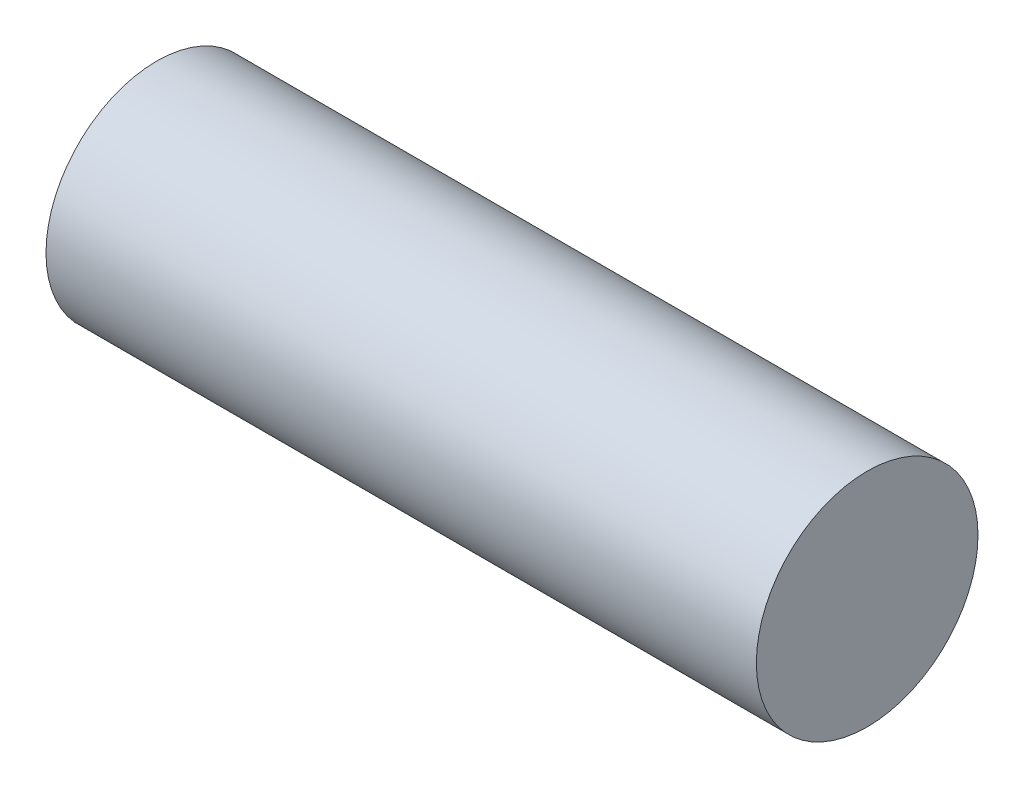
ISO-10303-21;
HEADER;
FILE_DESCRIPTION(('STEP AP214'),'2;1');
FILE_NAME('part.step','',(''),(''),'','','');
FILE_SCHEMA(('AUTOMOTIVE_DESIGN { 1 0 10303 214 1 1 1 1 }'));
ENDSEC;
DATA;
#1=APPLICATION_CONTEXT('core data for automotive mechanical design processes');
#2=APPLICATION_PROTOCOL_DEFINITION('international standard','automotive_design',2000,#1);
#3=PRODUCT_CONTEXT('',#1,'mechanical');
#4=PRODUCT('Part','Part','',(#3));
#5=PRODUCT_RELATED_PRODUCT_CATEGORY('part','',(#4));
#6=PRODUCT_DEFINITION_FORMATION('','',#4);
#7=PRODUCT_DEFINITION_CONTEXT('part definition',#1,'design');
#8=PRODUCT_DEFINITION('design','',#6,#7);
#9=PRODUCT_DEFINITION_SHAPE('','',#8);
#10=(LENGTH_UNIT() NAMED_UNIT(*) SI_UNIT(.MILLI.,.METRE.));
#11=(NAMED_UNIT(*) PLANE_ANGLE_UNIT() SI_UNIT($,.RADIAN.));
#12=(NAMED_UNIT(*) SI_UNIT($,.STERADIAN.) SOLID_ANGLE_UNIT());
#13=UNCERTAINTY_MEASURE_WITH_UNIT(LENGTH_MEASURE(1.E-05),#10,'distance_accuracy_value','');
#14=(GEOMETRIC_REPRESENTATION_CONTEXT(3) GLOBAL_UNCERTAINTY_ASSIGNED_CONTEXT((#13)) GLOBAL_UNIT_ASSIGNED_CONTEXT((#10,
#11,#12)) REPRESENTATION_CONTEXT('',''));
#15=CARTESIAN_POINT('',(0.,0.,0.));
#16=DIRECTION('',(0.,0.,1.));
#17=DIRECTION('',(1.,0.,0.));
#18=AXIS2_PLACEMENT_3D('',#15,#16,#17);
#19=CARTESIAN_POINT('',(6.35,0.,0.));
#20=DIRECTION('',(1.,0.,0.));
#21=DIRECTION('',(0.,0.,-1.));
#22=AXIS2_PLACEMENT_3D('',#19,#20,#21);
#23=PLANE('',#22);
#24=CARTESIAN_POINT('',(6.35,0.,0.));
#25=DIRECTION('',(-1.,0.,0.));
#26=DIRECTION('',(0.,0.,1.));
#27=AXIS2_PLACEMENT_3D('',#24,#25,#26);
#28=CIRCLE('',#27,1.9812);
#29=CARTESIAN_POINT('',(6.35,0.,1.9812));
#30=VERTEX_POINT('',#29);
#31=EDGE_CURVE('E18',#30,#30,#28,.T.);
#32=ORIENTED_EDGE('',*,*,#31,.F.);
#33=EDGE_LOOP('',(#32));
#34=FACE_BOUND('',#33,.T.);
#35=ADVANCED_FACE('F15',(#34),#23,.T.);
#36=CARTESIAN_POINT('',(-6.35,0.,0.));
#37=DIRECTION('',(1.,0.,0.));
#38=DIRECTION('',(0.,0.,-1.));
#39=AXIS2_PLACEMENT_3D('',#36,#37,#38);
#40=PLANE('',#39);
#41=CARTESIAN_POINT('',(-6.35,0.,0.));
#42=DIRECTION('',(-1.,0.,0.));
#43=DIRECTION('',(0.,0.,1.));
#44=AXIS2_PLACEMENT_3D('',#41,#42,#43);
#45=CIRCLE('',#44,1.9812);
#46=CARTESIAN_POINT('',(-6.35,0.,1.9812));
#47=VERTEX_POINT('',#46);
#48=EDGE_CURVE('E10',#47,#47,#45,.F.);
#49=ORIENTED_EDGE('',*,*,#48,.F.);
#50=EDGE_LOOP('',(#49));
#51=FACE_BOUND('',#50,.T.);
#52=ADVANCED_FACE('F30',(#51),#40,.F.);
#53=CARTESIAN_POINT('',(6.35,0.,0.));
#54=DIRECTION('',(-1.,0.,0.));
#55=DIRECTION('',(0.,0.,1.));
#56=AXIS2_PLACEMENT_3D('',#53,#54,#55);
#57=CYLINDRICAL_SURFACE('',#56,1.9812);
#58=ORIENTED_EDGE('',*,*,#48,.T.);
#59=EDGE_LOOP('',(#58));
#60=FACE_BOUND('',#59,.T.);
#61=ORIENTED_EDGE('',*,*,#31,.T.);
#62=EDGE_LOOP('',(#61));
#63=FACE_BOUND('',#62,.T.);
#64=ADVANCED_FACE('F27',(#60,#63),#57,.T.);
#65=CLOSED_SHELL('',(#35,#52,#64));
#66=MANIFOLD_SOLID_BREP('B1',#65);
#67=ADVANCED_BREP_SHAPE_REPRESENTATION('',(#18,#66),#14);
#68=SHAPE_DEFINITION_REPRESENTATION(#9,#67);
ENDSEC;
END-ISO-10303-21;
